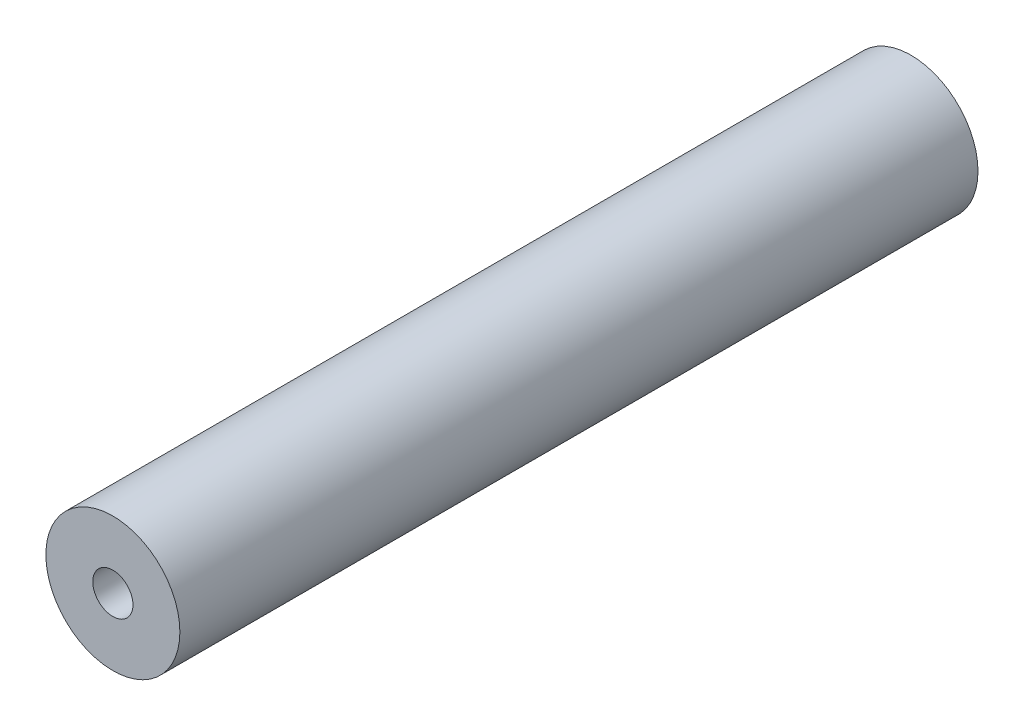
ISO-10303-21;
HEADER;
FILE_DESCRIPTION(('STEP AP214'),'2;1');
FILE_NAME('part.step','',(''),(''),'','','');
FILE_SCHEMA(('AUTOMOTIVE_DESIGN { 1 0 10303 214 1 1 1 1 }'));
ENDSEC;
DATA;
#1=APPLICATION_CONTEXT('core data for automotive mechanical design processes');
#2=APPLICATION_PROTOCOL_DEFINITION('international standard','automotive_design',2000,#1);
#3=PRODUCT_CONTEXT('',#1,'mechanical');
#4=PRODUCT('Part','Part','',(#3));
#5=PRODUCT_RELATED_PRODUCT_CATEGORY('part','',(#4));
#6=PRODUCT_DEFINITION_FORMATION('','',#4);
#7=PRODUCT_DEFINITION_CONTEXT('part definition',#1,'design');
#8=PRODUCT_DEFINITION('design','',#6,#7);
#9=PRODUCT_DEFINITION_SHAPE('','',#8);
#10=(LENGTH_UNIT() NAMED_UNIT(*) SI_UNIT(.MILLI.,.METRE.));
#11=(NAMED_UNIT(*) PLANE_ANGLE_UNIT() SI_UNIT($,.RADIAN.));
#12=(NAMED_UNIT(*) SI_UNIT($,.STERADIAN.) SOLID_ANGLE_UNIT());
#13=UNCERTAINTY_MEASURE_WITH_UNIT(LENGTH_MEASURE(1.E-05),#10,'distance_accuracy_value','');
#14=(GEOMETRIC_REPRESENTATION_CONTEXT(3) GLOBAL_UNCERTAINTY_ASSIGNED_CONTEXT((#13)) GLOBAL_UNIT_ASSIGNED_CONTEXT((#10,
#11,#12)) REPRESENTATION_CONTEXT('',''));
#15=CARTESIAN_POINT('',(0.,0.,0.));
#16=DIRECTION('',(0.,0.,1.));
#17=DIRECTION('',(1.,0.,0.));
#18=AXIS2_PLACEMENT_3D('',#15,#16,#17);
#19=CARTESIAN_POINT('',(0.,0.,378.206));
#20=DIRECTION('',(0.,0.,1.));
#21=DIRECTION('',(1.,0.,0.));
#22=AXIS2_PLACEMENT_3D('',#19,#20,#21);
#23=PLANE('',#22);
#24=CARTESIAN_POINT('',(0.,0.,378.206));
#25=DIRECTION('',(0.,0.,1.));
#26=DIRECTION('',(1.,0.,0.));
#27=AXIS2_PLACEMENT_3D('',#24,#25,#26);
#28=CIRCLE('',#27,31.75);
#29=CARTESIAN_POINT('',(31.75,0.,378.206));
#30=VERTEX_POINT('',#29);
#31=EDGE_CURVE('E10',#30,#30,#28,.T.);
#32=ORIENTED_EDGE('',*,*,#31,.T.);
#33=EDGE_LOOP('',(#32));
#34=FACE_BOUND('',#33,.T.);
#35=CARTESIAN_POINT('',(0.,0.,378.206));
#36=DIRECTION('',(0.,0.,1.));
#37=DIRECTION('',(1.,0.,0.));
#38=AXIS2_PLACEMENT_3D('',#35,#36,#37);
#39=CIRCLE('',#38,9.525);
#40=CARTESIAN_POINT('',(9.525,0.,378.206));
#41=VERTEX_POINT('',#40);
#42=EDGE_CURVE('E42',#41,#41,#39,.T.);
#43=ORIENTED_EDGE('',*,*,#42,.F.);
#44=EDGE_LOOP('',(#43));
#45=FACE_BOUND('',#44,.T.);
#46=ADVANCED_FACE('F31',(#34,#45),#23,.T.);
#47=CARTESIAN_POINT('',(0.,0.,0.));
#48=DIRECTION('',(0.,0.,1.));
#49=DIRECTION('',(1.,0.,0.));
#50=AXIS2_PLACEMENT_3D('',#47,#48,#49);
#51=PLANE('',#50);
#52=CARTESIAN_POINT('',(0.,0.,0.));
#53=DIRECTION('',(0.,0.,1.));
#54=DIRECTION('',(1.,0.,0.));
#55=AXIS2_PLACEMENT_3D('',#52,#53,#54);
#56=CIRCLE('',#55,31.75);
#57=CARTESIAN_POINT('',(31.75,0.,0.));
#58=VERTEX_POINT('',#57);
#59=EDGE_CURVE('E35',#58,#58,#56,.T.);
#60=ORIENTED_EDGE('',*,*,#59,.F.);
#61=EDGE_LOOP('',(#60));
#62=FACE_BOUND('',#61,.T.);
#63=CARTESIAN_POINT('',(0.,0.,0.));
#64=DIRECTION('',(0.,0.,1.));
#65=DIRECTION('',(1.,0.,0.));
#66=AXIS2_PLACEMENT_3D('',#63,#64,#65);
#67=CIRCLE('',#66,9.525);
#68=CARTESIAN_POINT('',(9.525,0.,0.));
#69=VERTEX_POINT('',#68);
#70=EDGE_CURVE('E44',#69,#69,#67,.T.);
#71=ORIENTED_EDGE('',*,*,#70,.T.);
#72=EDGE_LOOP('',(#71));
#73=FACE_BOUND('',#72,.T.);
#74=ADVANCED_FACE('F54',(#62,#73),#51,.F.);
#75=CARTESIAN_POINT('',(0.,0.,378.206));
#76=DIRECTION('',(0.,0.,-1.));
#77=DIRECTION('',(-1.,0.,0.));
#78=AXIS2_PLACEMENT_3D('',#75,#76,#77);
#79=CYLINDRICAL_SURFACE('',#78,31.75);
#80=ORIENTED_EDGE('',*,*,#31,.F.);
#81=EDGE_LOOP('',(#80));
#82=FACE_BOUND('',#81,.T.);
#83=ORIENTED_EDGE('',*,*,#59,.T.);
#84=EDGE_LOOP('',(#83));
#85=FACE_BOUND('',#84,.T.);
#86=ADVANCED_FACE('F33',(#82,#85),#79,.T.);
#87=CARTESIAN_POINT('',(0.,0.,378.206));
#88=DIRECTION('',(0.,0.,-1.));
#89=DIRECTION('',(-1.,0.,0.));
#90=AXIS2_PLACEMENT_3D('',#87,#88,#89);
#91=CYLINDRICAL_SURFACE('',#90,9.525);
#92=ORIENTED_EDGE('',*,*,#42,.T.);
#93=EDGE_LOOP('',(#92));
#94=FACE_BOUND('',#93,.T.);
#95=ORIENTED_EDGE('',*,*,#70,.F.);
#96=EDGE_LOOP('',(#95));
#97=FACE_BOUND('',#96,.T.);
#98=ADVANCED_FACE('F50',(#94,#97),#91,.F.);
#99=CLOSED_SHELL('',(#46,#74,#86,#98));
#100=MANIFOLD_SOLID_BREP('B2',#99);
#101=ADVANCED_BREP_SHAPE_REPRESENTATION('',(#18,#100),#14);
#102=SHAPE_DEFINITION_REPRESENTATION(#9,#101);
ENDSEC;
END-ISO-10303-21;
